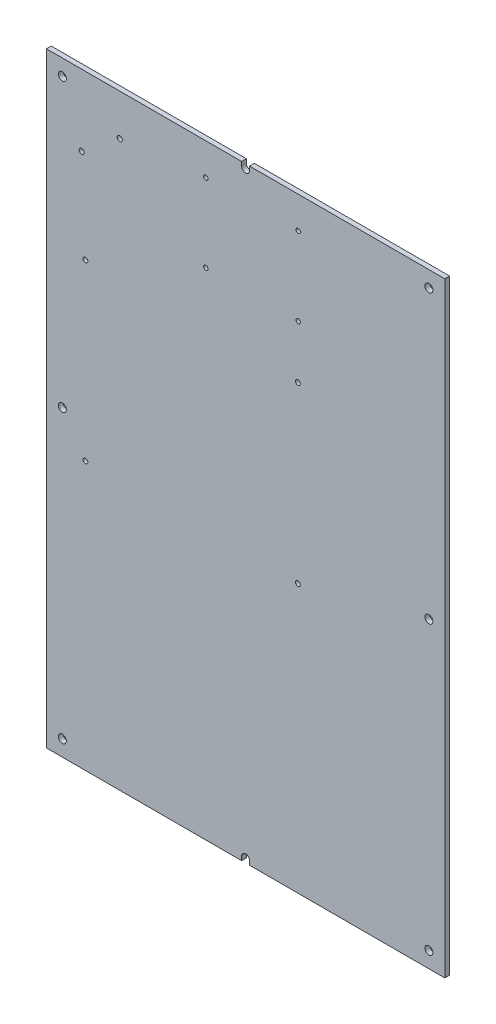
ISO-10303-21;
HEADER;
FILE_DESCRIPTION(('STEP AP214'),'2;1');
FILE_NAME('part.step','',(''),(''),'','','');
FILE_SCHEMA(('AUTOMOTIVE_DESIGN { 1 0 10303 214 1 1 1 1 }'));
ENDSEC;
DATA;
#1=APPLICATION_CONTEXT('core data for automotive mechanical design processes');
#2=APPLICATION_PROTOCOL_DEFINITION('international standard','automotive_design',2000,#1);
#3=PRODUCT_CONTEXT('',#1,'mechanical');
#4=PRODUCT('Part','Part','',(#3));
#5=PRODUCT_RELATED_PRODUCT_CATEGORY('part','',(#4));
#6=PRODUCT_DEFINITION_FORMATION('','',#4);
#7=PRODUCT_DEFINITION_CONTEXT('part definition',#1,'design');
#8=PRODUCT_DEFINITION('design','',#6,#7);
#9=PRODUCT_DEFINITION_SHAPE('','',#8);
#10=(LENGTH_UNIT() NAMED_UNIT(*) SI_UNIT(.MILLI.,.METRE.));
#11=(NAMED_UNIT(*) PLANE_ANGLE_UNIT() SI_UNIT($,.RADIAN.));
#12=(NAMED_UNIT(*) SI_UNIT($,.STERADIAN.) SOLID_ANGLE_UNIT());
#13=UNCERTAINTY_MEASURE_WITH_UNIT(LENGTH_MEASURE(1.E-05),#10,'distance_accuracy_value','');
#14=(GEOMETRIC_REPRESENTATION_CONTEXT(3) GLOBAL_UNCERTAINTY_ASSIGNED_CONTEXT((#13)) GLOBAL_UNIT_ASSIGNED_CONTEXT((#10,
#11,#12)) REPRESENTATION_CONTEXT('',''));
#15=CARTESIAN_POINT('',(0.,0.,0.));
#16=DIRECTION('',(0.,0.,1.));
#17=DIRECTION('',(1.,0.,0.));
#18=AXIS2_PLACEMENT_3D('',#15,#16,#17);
#19=CARTESIAN_POINT('',(89.8377845583719,-311.35282902829,3.));
#20=DIRECTION('',(0.,0.,-1.));
#21=DIRECTION('',(-1.,0.,0.));
#22=AXIS2_PLACEMENT_3D('',#19,#20,#21);
#23=PLANE('',#22);
#24=CARTESIAN_POINT('',(10.8490134095572,40.3288800368135,3.));
#25=DIRECTION('',(0.,0.,1.));
#26=DIRECTION('',(1.,0.,0.));
#27=AXIS2_PLACEMENT_3D('',#24,#25,#26);
#28=CIRCLE('',#27,1.6);
#29=CARTESIAN_POINT('',(12.4490134095572,40.3288800368135,3.));
#30=VERTEX_POINT('',#29);
#31=EDGE_CURVE('E338',#30,#30,#28,.T.);
#32=ORIENTED_EDGE('',*,*,#31,.F.);
#33=EDGE_LOOP('',(#32));
#34=FACE_BOUND('',#33,.T.);
#35=CARTESIAN_POINT('',(204.837784558372,-123.85282902829,3.));
#36=DIRECTION('',(0.,0.,1.));
#37=DIRECTION('',(1.,0.,0.));
#38=AXIS2_PLACEMENT_3D('',#35,#36,#37);
#39=CIRCLE('',#38,2.5);
#40=CARTESIAN_POINT('',(207.337784558372,-123.85282902829,3.));
#41=VERTEX_POINT('',#40);
#42=EDGE_CURVE('E350',#41,#41,#39,.T.);
#43=ORIENTED_EDGE('',*,*,#42,.F.);
#44=EDGE_LOOP('',(#43));
#45=FACE_BOUND('',#44,.T.);
#46=CARTESIAN_POINT('',(204.837784558372,-303.85282902829,3.));
#47=DIRECTION('',(0.,0.,1.));
#48=DIRECTION('',(1.,0.,0.));
#49=AXIS2_PLACEMENT_3D('',#46,#47,#48);
#50=CIRCLE('',#49,2.5);
#51=CARTESIAN_POINT('',(207.337784558372,-303.85282902829,3.));
#52=VERTEX_POINT('',#51);
#53=EDGE_CURVE('E362',#52,#52,#50,.T.);
#54=ORIENTED_EDGE('',*,*,#53,.F.);
#55=EDGE_LOOP('',(#54));
#56=FACE_BOUND('',#55,.T.);
#57=CARTESIAN_POINT('',(-25.1622154416282,56.14717097171,3.));
#58=DIRECTION('',(0.,0.,1.));
#59=DIRECTION('',(1.,0.,0.));
#60=AXIS2_PLACEMENT_3D('',#57,#58,#59);
#61=CIRCLE('',#60,2.5);
#62=CARTESIAN_POINT('',(-22.6622154416282,56.14717097171,3.));
#63=VERTEX_POINT('',#62);
#64=EDGE_CURVE('E374',#63,#63,#61,.T.);
#65=ORIENTED_EDGE('',*,*,#64,.F.);
#66=EDGE_LOOP('',(#65));
#67=FACE_BOUND('',#66,.T.);
#68=CARTESIAN_POINT('',(122.659013409557,-145.57282902829,3.));
#69=DIRECTION('',(0.,0.,1.));
#70=DIRECTION('',(1.,0.,0.));
#71=AXIS2_PLACEMENT_3D('',#68,#69,#70);
#72=CIRCLE('',#71,1.5);
#73=CARTESIAN_POINT('',(124.159013409557,-145.57282902829,3.));
#74=VERTEX_POINT('',#73);
#75=EDGE_CURVE('E386',#74,#74,#72,.T.);
#76=ORIENTED_EDGE('',*,*,#75,.F.);
#77=EDGE_LOOP('',(#76));
#78=FACE_BOUND('',#77,.T.);
#79=CARTESIAN_POINT('',(-10.6909865904428,-36.35282902829,3.));
#80=DIRECTION('',(0.,0.,1.));
#81=DIRECTION('',(1.,0.,0.));
#82=AXIS2_PLACEMENT_3D('',#79,#80,#81);
#83=CIRCLE('',#82,1.5);
#84=CARTESIAN_POINT('',(-9.19098659044277,-36.35282902829,3.));
#85=VERTEX_POINT('',#84);
#86=EDGE_CURVE('E398',#85,#85,#83,.T.);
#87=ORIENTED_EDGE('',*,*,#86,.F.);
#88=EDGE_LOOP('',(#87));
#89=FACE_BOUND('',#88,.T.);
#90=CARTESIAN_POINT('',(64.8377845583719,-2.85282902829004,3.));
#91=DIRECTION('',(0.,0.,1.));
#92=DIRECTION('',(1.,0.,0.));
#93=AXIS2_PLACEMENT_3D('',#90,#91,#92);
#94=CIRCLE('',#93,1.37500000000002);
#95=CARTESIAN_POINT('',(66.2127845583719,-2.85282902829004,3.));
#96=VERTEX_POINT('',#95);
#97=EDGE_CURVE('E410',#96,#96,#94,.T.);
#98=ORIENTED_EDGE('',*,*,#97,.F.);
#99=EDGE_LOOP('',(#98));
#100=FACE_BOUND('',#99,.T.);
#101=CARTESIAN_POINT('',(64.8377845583718,46.14717097171,3.));
#102=DIRECTION('',(0.,0.,1.));
#103=DIRECTION('',(1.,0.,0.));
#104=AXIS2_PLACEMENT_3D('',#101,#102,#103);
#105=CIRCLE('',#104,1.37500000000002);
#106=CARTESIAN_POINT('',(66.2127845583718,46.14717097171,3.));
#107=VERTEX_POINT('',#106);
#108=EDGE_CURVE('E156',#107,#107,#105,.T.);
#109=ORIENTED_EDGE('',*,*,#108,.F.);
#110=EDGE_LOOP('',(#109));
#111=FACE_BOUND('',#110,.T.);
#112=DIRECTION('',(-1.,0.,0.));
#113=VECTOR('',#112,1.);
#114=CARTESIAN_POINT('',(92.3377845583718,66.14717097171,3.));
#115=LINE('',#114,#113);
#116=CARTESIAN_POINT('',(214.837784558372,66.14717097171,3.));
#117=VERTEX_POINT('',#116);
#118=CARTESIAN_POINT('',(92.3377845583718,66.14717097171,3.));
#119=VERTEX_POINT('',#118);
#120=EDGE_CURVE('E175',#117,#119,#115,.T.);
#121=ORIENTED_EDGE('',*,*,#120,.T.);
#122=DIRECTION('',(0.,-1.,0.));
#123=VECTOR('',#122,1.);
#124=CARTESIAN_POINT('',(92.3377845583718,63.64717097171,3.));
#125=LINE('',#124,#123);
#126=CARTESIAN_POINT('',(92.3377845583718,63.64717097171,3.));
#127=VERTEX_POINT('',#126);
#128=EDGE_CURVE('E103',#119,#127,#125,.T.);
#129=ORIENTED_EDGE('',*,*,#128,.T.);
#130=CARTESIAN_POINT('',(89.8377845583718,63.64717097171,3.));
#131=DIRECTION('',(0.,0.,-1.));
#132=DIRECTION('',(1.,0.,0.));
#133=AXIS2_PLACEMENT_3D('',#130,#131,#132);
#134=CIRCLE('',#133,2.5);
#135=CARTESIAN_POINT('',(87.3377845583718,63.64717097171,3.));
#136=VERTEX_POINT('',#135);
#137=EDGE_CURVE('E202',#127,#136,#134,.T.);
#138=ORIENTED_EDGE('',*,*,#137,.T.);
#139=DIRECTION('',(0.,1.,0.));
#140=VECTOR('',#139,1.);
#141=CARTESIAN_POINT('',(87.3377845583718,63.64717097171,3.));
#142=LINE('',#141,#140);
#143=CARTESIAN_POINT('',(87.3377845583718,66.14717097171,3.));
#144=VERTEX_POINT('',#143);
#145=EDGE_CURVE('E221',#136,#144,#142,.T.);
#146=ORIENTED_EDGE('',*,*,#145,.T.);
#147=DIRECTION('',(-1.,0.,0.));
#148=VECTOR('',#147,1.);
#149=CARTESIAN_POINT('',(87.3377845583718,66.14717097171,3.));
#150=LINE('',#149,#148);
#151=CARTESIAN_POINT('',(-35.1622154416282,66.14717097171,3.));
#152=VERTEX_POINT('',#151);
#153=EDGE_CURVE('E218',#144,#152,#150,.T.);
#154=ORIENTED_EDGE('',*,*,#153,.T.);
#155=DIRECTION('',(0.,-1.,0.));
#156=VECTOR('',#155,1.);
#157=CARTESIAN_POINT('',(-35.1622154416282,66.14717097171,3.));
#158=LINE('',#157,#156);
#159=CARTESIAN_POINT('',(-35.1622154416282,-313.85282902829,3.));
#160=VERTEX_POINT('',#159);
#161=EDGE_CURVE('E220',#152,#160,#158,.T.);
#162=ORIENTED_EDGE('',*,*,#161,.T.);
#163=DIRECTION('',(1.,0.,0.));
#164=VECTOR('',#163,1.);
#165=CARTESIAN_POINT('',(87.3377845583719,-313.85282902829,3.));
#166=LINE('',#165,#164);
#167=CARTESIAN_POINT('',(87.3377845583719,-313.85282902829,3.));
#168=VERTEX_POINT('',#167);
#169=EDGE_CURVE('E223',#160,#168,#166,.T.);
#170=ORIENTED_EDGE('',*,*,#169,.T.);
#171=DIRECTION('',(0.,1.,0.));
#172=VECTOR('',#171,1.);
#173=CARTESIAN_POINT('',(87.3377845583719,-311.35282902829,3.));
#174=LINE('',#173,#172);
#175=CARTESIAN_POINT('',(87.3377845583719,-311.35282902829,3.));
#176=VERTEX_POINT('',#175);
#177=EDGE_CURVE('E229',#168,#176,#174,.T.);
#178=ORIENTED_EDGE('',*,*,#177,.T.);
#179=CARTESIAN_POINT('',(89.8377845583719,-311.35282902829,3.));
#180=DIRECTION('',(0.,0.,-1.));
#181=DIRECTION('',(-1.,0.,0.));
#182=AXIS2_PLACEMENT_3D('',#179,#180,#181);
#183=CIRCLE('',#182,2.50000000000002);
#184=CARTESIAN_POINT('',(92.3377845583719,-311.35282902829,3.));
#185=VERTEX_POINT('',#184);
#186=EDGE_CURVE('E134',#176,#185,#183,.T.);
#187=ORIENTED_EDGE('',*,*,#186,.T.);
#188=DIRECTION('',(0.,-1.,0.));
#189=VECTOR('',#188,1.);
#190=CARTESIAN_POINT('',(92.3377845583719,-311.35282902829,3.));
#191=LINE('',#190,#189);
#192=CARTESIAN_POINT('',(92.3377845583718,-313.85282902829,3.));
#193=VERTEX_POINT('',#192);
#194=EDGE_CURVE('E128',#185,#193,#191,.T.);
#195=ORIENTED_EDGE('',*,*,#194,.T.);
#196=DIRECTION('',(1.,0.,0.));
#197=VECTOR('',#196,1.);
#198=CARTESIAN_POINT('',(92.3377845583718,-313.85282902829,3.));
#199=LINE('',#198,#197);
#200=CARTESIAN_POINT('',(214.837784558372,-313.85282902829,3.));
#201=VERTEX_POINT('',#200);
#202=EDGE_CURVE('E132',#193,#201,#199,.T.);
#203=ORIENTED_EDGE('',*,*,#202,.T.);
#204=DIRECTION('',(0.,1.,0.));
#205=VECTOR('',#204,1.);
#206=CARTESIAN_POINT('',(214.837784558372,66.14717097171,3.));
#207=LINE('',#206,#205);
#208=EDGE_CURVE('E48',#201,#117,#207,.T.);
#209=ORIENTED_EDGE('',*,*,#208,.T.);
#210=EDGE_LOOP('',(#121,#129,#138,#146,#154,#162,#170,#178,#187,#195,#203,#209));
#211=FACE_BOUND('',#210,.T.);
#212=CARTESIAN_POINT('',(122.837784558372,46.14717097171,3.));
#213=DIRECTION('',(0.,0.,1.));
#214=DIRECTION('',(1.,0.,0.));
#215=AXIS2_PLACEMENT_3D('',#212,#213,#214);
#216=CIRCLE('',#215,1.37499999999996);
#217=CARTESIAN_POINT('',(124.212784558372,46.14717097171,3.));
#218=VERTEX_POINT('',#217);
#219=EDGE_CURVE('E416',#218,#218,#216,.T.);
#220=ORIENTED_EDGE('',*,*,#219,.F.);
#221=EDGE_LOOP('',(#220));
#222=FACE_BOUND('',#221,.T.);
#223=CARTESIAN_POINT('',(122.837784558372,-2.85282902829005,3.));
#224=DIRECTION('',(0.,0.,1.));
#225=DIRECTION('',(1.,0.,0.));
#226=AXIS2_PLACEMENT_3D('',#223,#224,#225);
#227=CIRCLE('',#226,1.37499999999999);
#228=CARTESIAN_POINT('',(124.212784558372,-2.85282902829005,3.));
#229=VERTEX_POINT('',#228);
#230=EDGE_CURVE('E404',#229,#229,#227,.T.);
#231=ORIENTED_EDGE('',*,*,#230,.F.);
#232=EDGE_LOOP('',(#231));
#233=FACE_BOUND('',#232,.T.);
#234=CARTESIAN_POINT('',(122.659013409557,-36.35282902829,3.));
#235=DIRECTION('',(0.,0.,1.));
#236=DIRECTION('',(1.,0.,0.));
#237=AXIS2_PLACEMENT_3D('',#234,#235,#236);
#238=CIRCLE('',#237,1.5);
#239=CARTESIAN_POINT('',(124.159013409557,-36.35282902829,3.));
#240=VERTEX_POINT('',#239);
#241=EDGE_CURVE('E392',#240,#240,#238,.T.);
#242=ORIENTED_EDGE('',*,*,#241,.F.);
#243=EDGE_LOOP('',(#242));
#244=FACE_BOUND('',#243,.T.);
#245=CARTESIAN_POINT('',(-10.6909865904426,-145.57282902829,3.));
#246=DIRECTION('',(0.,0.,1.));
#247=DIRECTION('',(1.,0.,0.));
#248=AXIS2_PLACEMENT_3D('',#245,#246,#247);
#249=CIRCLE('',#248,1.5);
#250=CARTESIAN_POINT('',(-9.1909865904426,-145.57282902829,3.));
#251=VERTEX_POINT('',#250);
#252=EDGE_CURVE('E380',#251,#251,#249,.T.);
#253=ORIENTED_EDGE('',*,*,#252,.F.);
#254=EDGE_LOOP('',(#253));
#255=FACE_BOUND('',#254,.T.);
#256=CARTESIAN_POINT('',(204.837784558372,56.14717097171,3.));
#257=DIRECTION('',(0.,0.,1.));
#258=DIRECTION('',(-1.,0.,0.));
#259=AXIS2_PLACEMENT_3D('',#256,#257,#258);
#260=CIRCLE('',#259,2.5);
#261=CARTESIAN_POINT('',(202.337784558372,56.14717097171,3.));
#262=VERTEX_POINT('',#261);
#263=EDGE_CURVE('E368',#262,#262,#260,.T.);
#264=ORIENTED_EDGE('',*,*,#263,.F.);
#265=EDGE_LOOP('',(#264));
#266=FACE_BOUND('',#265,.T.);
#267=CARTESIAN_POINT('',(-25.1622154416282,-303.85282902829,3.));
#268=DIRECTION('',(0.,0.,1.));
#269=DIRECTION('',(-1.,0.,0.));
#270=AXIS2_PLACEMENT_3D('',#267,#268,#269);
#271=CIRCLE('',#270,2.5);
#272=CARTESIAN_POINT('',(-27.6622154416282,-303.85282902829,3.));
#273=VERTEX_POINT('',#272);
#274=EDGE_CURVE('E356',#273,#273,#271,.T.);
#275=ORIENTED_EDGE('',*,*,#274,.F.);
#276=EDGE_LOOP('',(#275));
#277=FACE_BOUND('',#276,.T.);
#278=CARTESIAN_POINT('',(-25.1622154416281,-123.85282902829,3.));
#279=DIRECTION('',(0.,0.,1.));
#280=DIRECTION('',(-1.,0.,0.));
#281=AXIS2_PLACEMENT_3D('',#278,#279,#280);
#282=CIRCLE('',#281,2.5);
#283=CARTESIAN_POINT('',(-27.6622154416281,-123.85282902829,3.));
#284=VERTEX_POINT('',#283);
#285=EDGE_CURVE('E344',#284,#284,#282,.T.);
#286=ORIENTED_EDGE('',*,*,#285,.F.);
#287=EDGE_LOOP('',(#286));
#288=FACE_BOUND('',#287,.T.);
#289=CARTESIAN_POINT('',(-13.0209865904428,21.4888800368135,3.));
#290=DIRECTION('',(0.,0.,1.));
#291=DIRECTION('',(1.,0.,0.));
#292=AXIS2_PLACEMENT_3D('',#289,#290,#291);
#293=CIRCLE('',#292,1.6);
#294=CARTESIAN_POINT('',(-11.4209865904428,21.4888800368135,3.));
#295=VERTEX_POINT('',#294);
#296=EDGE_CURVE('E329',#295,#295,#293,.T.);
#297=ORIENTED_EDGE('',*,*,#296,.F.);
#298=EDGE_LOOP('',(#297));
#299=FACE_BOUND('',#298,.T.);
#300=ADVANCED_FACE('F31',(#34,#45,#56,#67,#78,#89,#100,#111,#211,#222,#233,#244,#255,#266,#277,
#288,#299),#23,.F.);
#301=CARTESIAN_POINT('',(89.8377845583719,-311.35282902829,0.));
#302=DIRECTION('',(0.,0.,-1.));
#303=DIRECTION('',(-1.,0.,0.));
#304=AXIS2_PLACEMENT_3D('',#301,#302,#303);
#305=PLANE('',#304);
#306=CARTESIAN_POINT('',(10.8490134095572,40.3288800368135,0.));
#307=DIRECTION('',(0.,0.,1.));
#308=DIRECTION('',(1.,0.,0.));
#309=AXIS2_PLACEMENT_3D('',#306,#307,#308);
#310=CIRCLE('',#309,1.6);
#311=CARTESIAN_POINT('',(12.4490134095572,40.3288800368135,0.));
#312=VERTEX_POINT('',#311);
#313=EDGE_CURVE('E335',#312,#312,#310,.T.);
#314=ORIENTED_EDGE('',*,*,#313,.T.);
#315=EDGE_LOOP('',(#314));
#316=FACE_BOUND('',#315,.T.);
#317=CARTESIAN_POINT('',(204.837784558372,-123.85282902829,0.));
#318=DIRECTION('',(0.,0.,1.));
#319=DIRECTION('',(1.,0.,0.));
#320=AXIS2_PLACEMENT_3D('',#317,#318,#319);
#321=CIRCLE('',#320,2.5);
#322=CARTESIAN_POINT('',(207.337784558372,-123.85282902829,0.));
#323=VERTEX_POINT('',#322);
#324=EDGE_CURVE('E347',#323,#323,#321,.T.);
#325=ORIENTED_EDGE('',*,*,#324,.T.);
#326=EDGE_LOOP('',(#325));
#327=FACE_BOUND('',#326,.T.);
#328=CARTESIAN_POINT('',(204.837784558372,-303.85282902829,0.));
#329=DIRECTION('',(0.,0.,1.));
#330=DIRECTION('',(1.,0.,0.));
#331=AXIS2_PLACEMENT_3D('',#328,#329,#330);
#332=CIRCLE('',#331,2.5);
#333=CARTESIAN_POINT('',(207.337784558372,-303.85282902829,0.));
#334=VERTEX_POINT('',#333);
#335=EDGE_CURVE('E359',#334,#334,#332,.T.);
#336=ORIENTED_EDGE('',*,*,#335,.T.);
#337=EDGE_LOOP('',(#336));
#338=FACE_BOUND('',#337,.T.);
#339=CARTESIAN_POINT('',(-25.1622154416282,56.14717097171,0.));
#340=DIRECTION('',(0.,0.,1.));
#341=DIRECTION('',(1.,0.,0.));
#342=AXIS2_PLACEMENT_3D('',#339,#340,#341);
#343=CIRCLE('',#342,2.5);
#344=CARTESIAN_POINT('',(-22.6622154416282,56.14717097171,0.));
#345=VERTEX_POINT('',#344);
#346=EDGE_CURVE('E371',#345,#345,#343,.T.);
#347=ORIENTED_EDGE('',*,*,#346,.T.);
#348=EDGE_LOOP('',(#347));
#349=FACE_BOUND('',#348,.T.);
#350=CARTESIAN_POINT('',(122.659013409557,-145.57282902829,0.));
#351=DIRECTION('',(0.,0.,1.));
#352=DIRECTION('',(1.,0.,0.));
#353=AXIS2_PLACEMENT_3D('',#350,#351,#352);
#354=CIRCLE('',#353,1.5);
#355=CARTESIAN_POINT('',(124.159013409557,-145.57282902829,0.));
#356=VERTEX_POINT('',#355);
#357=EDGE_CURVE('E383',#356,#356,#354,.T.);
#358=ORIENTED_EDGE('',*,*,#357,.T.);
#359=EDGE_LOOP('',(#358));
#360=FACE_BOUND('',#359,.T.);
#361=CARTESIAN_POINT('',(-10.6909865904428,-36.35282902829,0.));
#362=DIRECTION('',(0.,0.,1.));
#363=DIRECTION('',(1.,0.,0.));
#364=AXIS2_PLACEMENT_3D('',#361,#362,#363);
#365=CIRCLE('',#364,1.5);
#366=CARTESIAN_POINT('',(-9.19098659044277,-36.35282902829,0.));
#367=VERTEX_POINT('',#366);
#368=EDGE_CURVE('E395',#367,#367,#365,.T.);
#369=ORIENTED_EDGE('',*,*,#368,.T.);
#370=EDGE_LOOP('',(#369));
#371=FACE_BOUND('',#370,.T.);
#372=CARTESIAN_POINT('',(64.8377845583719,-2.85282902829004,0.));
#373=DIRECTION('',(0.,0.,1.));
#374=DIRECTION('',(1.,0.,0.));
#375=AXIS2_PLACEMENT_3D('',#372,#373,#374);
#376=CIRCLE('',#375,1.37500000000002);
#377=CARTESIAN_POINT('',(66.2127845583719,-2.85282902829004,0.));
#378=VERTEX_POINT('',#377);
#379=EDGE_CURVE('E407',#378,#378,#376,.T.);
#380=ORIENTED_EDGE('',*,*,#379,.T.);
#381=EDGE_LOOP('',(#380));
#382=FACE_BOUND('',#381,.T.);
#383=CARTESIAN_POINT('',(64.8377845583718,46.14717097171,0.));
#384=DIRECTION('',(0.,0.,1.));
#385=DIRECTION('',(1.,0.,0.));
#386=AXIS2_PLACEMENT_3D('',#383,#384,#385);
#387=CIRCLE('',#386,1.37500000000002);
#388=CARTESIAN_POINT('',(66.2127845583718,46.14717097171,0.));
#389=VERTEX_POINT('',#388);
#390=EDGE_CURVE('E419',#389,#389,#387,.T.);
#391=ORIENTED_EDGE('',*,*,#390,.T.);
#392=EDGE_LOOP('',(#391));
#393=FACE_BOUND('',#392,.T.);
#394=DIRECTION('',(-1.,0.,0.));
#395=VECTOR('',#394,1.);
#396=CARTESIAN_POINT('',(92.3377845583718,66.14717097171,0.));
#397=LINE('',#396,#395);
#398=CARTESIAN_POINT('',(214.837784558372,66.14717097171,0.));
#399=VERTEX_POINT('',#398);
#400=CARTESIAN_POINT('',(92.3377845583718,66.14717097171,0.));
#401=VERTEX_POINT('',#400);
#402=EDGE_CURVE('E152',#399,#401,#397,.T.);
#403=ORIENTED_EDGE('',*,*,#402,.F.);
#404=DIRECTION('',(0.,1.,0.));
#405=VECTOR('',#404,1.);
#406=CARTESIAN_POINT('',(214.837784558372,66.14717097171,0.));
#407=LINE('',#406,#405);
#408=CARTESIAN_POINT('',(214.837784558372,-313.85282902829,0.));
#409=VERTEX_POINT('',#408);
#410=EDGE_CURVE('E95',#409,#399,#407,.T.);
#411=ORIENTED_EDGE('',*,*,#410,.F.);
#412=DIRECTION('',(1.,0.,0.));
#413=VECTOR('',#412,1.);
#414=CARTESIAN_POINT('',(92.3377845583718,-313.85282902829,0.));
#415=LINE('',#414,#413);
#416=CARTESIAN_POINT('',(92.3377845583718,-313.85282902829,0.));
#417=VERTEX_POINT('',#416);
#418=EDGE_CURVE('E89',#417,#409,#415,.T.);
#419=ORIENTED_EDGE('',*,*,#418,.F.);
#420=DIRECTION('',(0.,-1.,0.));
#421=VECTOR('',#420,1.);
#422=CARTESIAN_POINT('',(92.3377845583719,-311.35282902829,0.));
#423=LINE('',#422,#421);
#424=CARTESIAN_POINT('',(92.3377845583719,-311.35282902829,0.));
#425=VERTEX_POINT('',#424);
#426=EDGE_CURVE('E142',#425,#417,#423,.T.);
#427=ORIENTED_EDGE('',*,*,#426,.F.);
#428=CARTESIAN_POINT('',(89.8377845583719,-311.35282902829,0.));
#429=DIRECTION('',(0.,0.,-1.));
#430=DIRECTION('',(-1.,0.,0.));
#431=AXIS2_PLACEMENT_3D('',#428,#429,#430);
#432=CIRCLE('',#431,2.50000000000002);
#433=CARTESIAN_POINT('',(87.3377845583719,-311.35282902829,0.));
#434=VERTEX_POINT('',#433);
#435=EDGE_CURVE('E170',#434,#425,#432,.T.);
#436=ORIENTED_EDGE('',*,*,#435,.F.);
#437=DIRECTION('',(0.,1.,0.));
#438=VECTOR('',#437,1.);
#439=CARTESIAN_POINT('',(87.3377845583719,-311.35282902829,0.));
#440=LINE('',#439,#438);
#441=CARTESIAN_POINT('',(87.3377845583719,-313.85282902829,0.));
#442=VERTEX_POINT('',#441);
#443=EDGE_CURVE('E168',#442,#434,#440,.T.);
#444=ORIENTED_EDGE('',*,*,#443,.F.);
#445=DIRECTION('',(1.,0.,0.));
#446=VECTOR('',#445,1.);
#447=CARTESIAN_POINT('',(87.3377845583719,-313.85282902829,0.));
#448=LINE('',#447,#446);
#449=CARTESIAN_POINT('',(-35.1622154416282,-313.85282902829,0.));
#450=VERTEX_POINT('',#449);
#451=EDGE_CURVE('E166',#450,#442,#448,.T.);
#452=ORIENTED_EDGE('',*,*,#451,.F.);
#453=DIRECTION('',(0.,-1.,0.));
#454=VECTOR('',#453,1.);
#455=CARTESIAN_POINT('',(-35.1622154416282,66.14717097171,0.));
#456=LINE('',#455,#454);
#457=CARTESIAN_POINT('',(-35.1622154416282,66.14717097171,0.));
#458=VERTEX_POINT('',#457);
#459=EDGE_CURVE('E164',#458,#450,#456,.T.);
#460=ORIENTED_EDGE('',*,*,#459,.F.);
#461=DIRECTION('',(-1.,0.,0.));
#462=VECTOR('',#461,1.);
#463=CARTESIAN_POINT('',(87.3377845583718,66.14717097171,0.));
#464=LINE('',#463,#462);
#465=CARTESIAN_POINT('',(87.3377845583718,66.14717097171,0.));
#466=VERTEX_POINT('',#465);
#467=EDGE_CURVE('E162',#466,#458,#464,.T.);
#468=ORIENTED_EDGE('',*,*,#467,.F.);
#469=DIRECTION('',(0.,1.,0.));
#470=VECTOR('',#469,1.);
#471=CARTESIAN_POINT('',(87.3377845583718,63.64717097171,0.));
#472=LINE('',#471,#470);
#473=CARTESIAN_POINT('',(87.3377845583718,63.64717097171,0.));
#474=VERTEX_POINT('',#473);
#475=EDGE_CURVE('E160',#474,#466,#472,.T.);
#476=ORIENTED_EDGE('',*,*,#475,.F.);
#477=CARTESIAN_POINT('',(89.8377845583718,63.64717097171,0.));
#478=DIRECTION('',(0.,0.,-1.));
#479=DIRECTION('',(1.,0.,0.));
#480=AXIS2_PLACEMENT_3D('',#477,#478,#479);
#481=CIRCLE('',#480,2.5);
#482=CARTESIAN_POINT('',(92.3377845583718,63.64717097171,0.));
#483=VERTEX_POINT('',#482);
#484=EDGE_CURVE('E158',#483,#474,#481,.T.);
#485=ORIENTED_EDGE('',*,*,#484,.F.);
#486=DIRECTION('',(0.,-1.,0.));
#487=VECTOR('',#486,1.);
#488=CARTESIAN_POINT('',(92.3377845583718,63.64717097171,0.));
#489=LINE('',#488,#487);
#490=EDGE_CURVE('E155',#401,#483,#489,.T.);
#491=ORIENTED_EDGE('',*,*,#490,.F.);
#492=EDGE_LOOP('',(#403,#411,#419,#427,#436,#444,#452,#460,#468,#476,#485,#491));
#493=FACE_BOUND('',#492,.T.);
#494=CARTESIAN_POINT('',(122.837784558372,46.14717097171,0.));
#495=DIRECTION('',(0.,0.,1.));
#496=DIRECTION('',(1.,0.,0.));
#497=AXIS2_PLACEMENT_3D('',#494,#495,#496);
#498=CIRCLE('',#497,1.37499999999996);
#499=CARTESIAN_POINT('',(124.212784558372,46.14717097171,0.));
#500=VERTEX_POINT('',#499);
#501=EDGE_CURVE('E413',#500,#500,#498,.T.);
#502=ORIENTED_EDGE('',*,*,#501,.T.);
#503=EDGE_LOOP('',(#502));
#504=FACE_BOUND('',#503,.T.);
#505=CARTESIAN_POINT('',(122.837784558372,-2.85282902829005,0.));
#506=DIRECTION('',(0.,0.,1.));
#507=DIRECTION('',(1.,0.,0.));
#508=AXIS2_PLACEMENT_3D('',#505,#506,#507);
#509=CIRCLE('',#508,1.37499999999999);
#510=CARTESIAN_POINT('',(124.212784558372,-2.85282902829005,0.));
#511=VERTEX_POINT('',#510);
#512=EDGE_CURVE('E401',#511,#511,#509,.T.);
#513=ORIENTED_EDGE('',*,*,#512,.T.);
#514=EDGE_LOOP('',(#513));
#515=FACE_BOUND('',#514,.T.);
#516=CARTESIAN_POINT('',(122.659013409557,-36.35282902829,0.));
#517=DIRECTION('',(0.,0.,1.));
#518=DIRECTION('',(1.,0.,0.));
#519=AXIS2_PLACEMENT_3D('',#516,#517,#518);
#520=CIRCLE('',#519,1.5);
#521=CARTESIAN_POINT('',(124.159013409557,-36.35282902829,0.));
#522=VERTEX_POINT('',#521);
#523=EDGE_CURVE('E389',#522,#522,#520,.T.);
#524=ORIENTED_EDGE('',*,*,#523,.T.);
#525=EDGE_LOOP('',(#524));
#526=FACE_BOUND('',#525,.T.);
#527=CARTESIAN_POINT('',(-10.6909865904426,-145.57282902829,0.));
#528=DIRECTION('',(0.,0.,1.));
#529=DIRECTION('',(1.,0.,0.));
#530=AXIS2_PLACEMENT_3D('',#527,#528,#529);
#531=CIRCLE('',#530,1.5);
#532=CARTESIAN_POINT('',(-9.1909865904426,-145.57282902829,0.));
#533=VERTEX_POINT('',#532);
#534=EDGE_CURVE('E377',#533,#533,#531,.T.);
#535=ORIENTED_EDGE('',*,*,#534,.T.);
#536=EDGE_LOOP('',(#535));
#537=FACE_BOUND('',#536,.T.);
#538=CARTESIAN_POINT('',(204.837784558372,56.14717097171,0.));
#539=DIRECTION('',(0.,0.,1.));
#540=DIRECTION('',(-1.,0.,0.));
#541=AXIS2_PLACEMENT_3D('',#538,#539,#540);
#542=CIRCLE('',#541,2.5);
#543=CARTESIAN_POINT('',(202.337784558372,56.14717097171,0.));
#544=VERTEX_POINT('',#543);
#545=EDGE_CURVE('E365',#544,#544,#542,.T.);
#546=ORIENTED_EDGE('',*,*,#545,.T.);
#547=EDGE_LOOP('',(#546));
#548=FACE_BOUND('',#547,.T.);
#549=CARTESIAN_POINT('',(-25.1622154416282,-303.85282902829,0.));
#550=DIRECTION('',(0.,0.,1.));
#551=DIRECTION('',(-1.,0.,0.));
#552=AXIS2_PLACEMENT_3D('',#549,#550,#551);
#553=CIRCLE('',#552,2.5);
#554=CARTESIAN_POINT('',(-27.6622154416282,-303.85282902829,0.));
#555=VERTEX_POINT('',#554);
#556=EDGE_CURVE('E353',#555,#555,#553,.T.);
#557=ORIENTED_EDGE('',*,*,#556,.T.);
#558=EDGE_LOOP('',(#557));
#559=FACE_BOUND('',#558,.T.);
#560=CARTESIAN_POINT('',(-25.1622154416281,-123.85282902829,0.));
#561=DIRECTION('',(0.,0.,1.));
#562=DIRECTION('',(-1.,0.,0.));
#563=AXIS2_PLACEMENT_3D('',#560,#561,#562);
#564=CIRCLE('',#563,2.5);
#565=CARTESIAN_POINT('',(-27.6622154416281,-123.85282902829,0.));
#566=VERTEX_POINT('',#565);
#567=EDGE_CURVE('E341',#566,#566,#564,.T.);
#568=ORIENTED_EDGE('',*,*,#567,.T.);
#569=EDGE_LOOP('',(#568));
#570=FACE_BOUND('',#569,.T.);
#571=CARTESIAN_POINT('',(-13.0209865904428,21.4888800368135,0.));
#572=DIRECTION('',(0.,0.,1.));
#573=DIRECTION('',(1.,0.,0.));
#574=AXIS2_PLACEMENT_3D('',#571,#572,#573);
#575=CIRCLE('',#574,1.6);
#576=CARTESIAN_POINT('',(-11.4209865904428,21.4888800368135,0.));
#577=VERTEX_POINT('',#576);
#578=EDGE_CURVE('E332',#577,#577,#575,.T.);
#579=ORIENTED_EDGE('',*,*,#578,.T.);
#580=EDGE_LOOP('',(#579));
#581=FACE_BOUND('',#580,.T.);
#582=ADVANCED_FACE('F206',(#316,#327,#338,#349,#360,#371,#382,#393,#493,#504,#515,#526,#537,
#548,#559,#570,#581),#305,.T.);
#583=CARTESIAN_POINT('',(92.3377845583718,66.14717097171,3.));
#584=DIRECTION('',(0.,-1.,0.));
#585=DIRECTION('',(1.,0.,0.));
#586=AXIS2_PLACEMENT_3D('',#583,#584,#585);
#587=PLANE('',#586);
#588=ORIENTED_EDGE('',*,*,#402,.T.);
#589=DIRECTION('',(0.,0.,-1.));
#590=VECTOR('',#589,1.);
#591=CARTESIAN_POINT('',(92.3377845583718,66.14717097171,3.));
#592=LINE('',#591,#590);
#593=EDGE_CURVE('E11',#119,#401,#592,.T.);
#594=ORIENTED_EDGE('',*,*,#593,.F.);
#595=ORIENTED_EDGE('',*,*,#120,.F.);
#596=DIRECTION('',(0.,0.,-1.));
#597=VECTOR('',#596,1.);
#598=CARTESIAN_POINT('',(214.837784558372,66.14717097171,3.));
#599=LINE('',#598,#597);
#600=EDGE_CURVE('E148',#117,#399,#599,.T.);
#601=ORIENTED_EDGE('',*,*,#600,.T.);
#602=EDGE_LOOP('',(#588,#594,#595,#601));
#603=FACE_BOUND('',#602,.T.);
#604=ADVANCED_FACE('F33',(#603),#587,.F.);
#605=CARTESIAN_POINT('',(92.3377845583718,63.64717097171,3.));
#606=DIRECTION('',(1.,0.,0.));
#607=DIRECTION('',(0.,1.,0.));
#608=AXIS2_PLACEMENT_3D('',#605,#606,#607);
#609=PLANE('',#608);
#610=ORIENTED_EDGE('',*,*,#490,.T.);
#611=DIRECTION('',(0.,0.,-1.));
#612=VECTOR('',#611,1.);
#613=CARTESIAN_POINT('',(92.3377845583718,63.64717097171,3.));
#614=LINE('',#613,#612);
#615=EDGE_CURVE('E40',#127,#483,#614,.T.);
#616=ORIENTED_EDGE('',*,*,#615,.F.);
#617=ORIENTED_EDGE('',*,*,#128,.F.);
#618=ORIENTED_EDGE('',*,*,#593,.T.);
#619=EDGE_LOOP('',(#610,#616,#617,#618));
#620=FACE_BOUND('',#619,.T.);
#621=ADVANCED_FACE('F636',(#620),#609,.F.);
#622=CARTESIAN_POINT('',(89.8377845583718,63.64717097171,3.));
#623=DIRECTION('',(0.,0.,-1.));
#624=DIRECTION('',(-1.,0.,0.));
#625=AXIS2_PLACEMENT_3D('',#622,#623,#624);
#626=CYLINDRICAL_SURFACE('',#625,2.5);
#627=ORIENTED_EDGE('',*,*,#484,.T.);
#628=DIRECTION('',(0.,0.,-1.));
#629=VECTOR('',#628,1.);
#630=CARTESIAN_POINT('',(87.3377845583718,63.64717097171,3.));
#631=LINE('',#630,#629);
#632=EDGE_CURVE('E194',#136,#474,#631,.T.);
#633=ORIENTED_EDGE('',*,*,#632,.F.);
#634=ORIENTED_EDGE('',*,*,#137,.F.);
#635=ORIENTED_EDGE('',*,*,#615,.T.);
#636=EDGE_LOOP('',(#627,#633,#634,#635));
#637=FACE_BOUND('',#636,.T.);
#638=ADVANCED_FACE('F200',(#637),#626,.F.);
#639=CARTESIAN_POINT('',(87.3377845583718,63.64717097171,3.));
#640=DIRECTION('',(-1.,0.,0.));
#641=DIRECTION('',(0.,-1.,0.));
#642=AXIS2_PLACEMENT_3D('',#639,#640,#641);
#643=PLANE('',#642);
#644=ORIENTED_EDGE('',*,*,#475,.T.);
#645=DIRECTION('',(0.,0.,-1.));
#646=VECTOR('',#645,1.);
#647=CARTESIAN_POINT('',(87.3377845583718,66.14717097171,3.));
#648=LINE('',#647,#646);
#649=EDGE_CURVE('E191',#144,#466,#648,.T.);
#650=ORIENTED_EDGE('',*,*,#649,.F.);
#651=ORIENTED_EDGE('',*,*,#145,.F.);
#652=ORIENTED_EDGE('',*,*,#632,.T.);
#653=EDGE_LOOP('',(#644,#650,#651,#652));
#654=FACE_BOUND('',#653,.T.);
#655=ADVANCED_FACE('F212',(#654),#643,.F.);
#656=CARTESIAN_POINT('',(87.3377845583718,66.14717097171,3.));
#657=DIRECTION('',(0.,-1.,0.));
#658=DIRECTION('',(0.,0.,-1.));
#659=AXIS2_PLACEMENT_3D('',#656,#657,#658);
#660=PLANE('',#659);
#661=ORIENTED_EDGE('',*,*,#467,.T.);
#662=DIRECTION('',(0.,0.,-1.));
#663=VECTOR('',#662,1.);
#664=CARTESIAN_POINT('',(-35.1622154416282,66.14717097171,3.));
#665=LINE('',#664,#663);
#666=EDGE_CURVE('E188',#152,#458,#665,.T.);
#667=ORIENTED_EDGE('',*,*,#666,.F.);
#668=ORIENTED_EDGE('',*,*,#153,.F.);
#669=ORIENTED_EDGE('',*,*,#649,.T.);
#670=EDGE_LOOP('',(#661,#667,#668,#669));
#671=FACE_BOUND('',#670,.T.);
#672=ADVANCED_FACE('F216',(#671),#660,.F.);
#673=CARTESIAN_POINT('',(-35.1622154416282,66.14717097171,3.));
#674=DIRECTION('',(1.,0.,0.));
#675=DIRECTION('',(0.,0.,-1.));
#676=AXIS2_PLACEMENT_3D('',#673,#674,#675);
#677=PLANE('',#676);
#678=ORIENTED_EDGE('',*,*,#459,.T.);
#679=DIRECTION('',(0.,0.,-1.));
#680=VECTOR('',#679,1.);
#681=CARTESIAN_POINT('',(-35.1622154416282,-313.85282902829,3.));
#682=LINE('',#681,#680);
#683=EDGE_CURVE('E185',#160,#450,#682,.T.);
#684=ORIENTED_EDGE('',*,*,#683,.F.);
#685=ORIENTED_EDGE('',*,*,#161,.F.);
#686=ORIENTED_EDGE('',*,*,#666,.T.);
#687=EDGE_LOOP('',(#678,#684,#685,#686));
#688=FACE_BOUND('',#687,.T.);
#689=ADVANCED_FACE('F601',(#688),#677,.F.);
#690=CARTESIAN_POINT('',(87.3377845583719,-313.85282902829,3.));
#691=DIRECTION('',(0.,1.,0.));
#692=DIRECTION('',(0.,0.,1.));
#693=AXIS2_PLACEMENT_3D('',#690,#691,#692);
#694=PLANE('',#693);
#695=ORIENTED_EDGE('',*,*,#451,.T.);
#696=DIRECTION('',(0.,0.,-1.));
#697=VECTOR('',#696,1.);
#698=CARTESIAN_POINT('',(87.3377845583719,-313.85282902829,3.));
#699=LINE('',#698,#697);
#700=EDGE_CURVE('E182',#168,#442,#699,.T.);
#701=ORIENTED_EDGE('',*,*,#700,.F.);
#702=ORIENTED_EDGE('',*,*,#169,.F.);
#703=ORIENTED_EDGE('',*,*,#683,.T.);
#704=EDGE_LOOP('',(#695,#701,#702,#703));
#705=FACE_BOUND('',#704,.T.);
#706=ADVANCED_FACE('F592',(#705),#694,.F.);
#707=CARTESIAN_POINT('',(87.3377845583719,-311.35282902829,3.));
#708=DIRECTION('',(-1.,0.,0.));
#709=DIRECTION('',(0.,0.,1.));
#710=AXIS2_PLACEMENT_3D('',#707,#708,#709);
#711=PLANE('',#710);
#712=ORIENTED_EDGE('',*,*,#443,.T.);
#713=DIRECTION('',(0.,0.,-1.));
#714=VECTOR('',#713,1.);
#715=CARTESIAN_POINT('',(87.3377845583719,-311.35282902829,3.));
#716=LINE('',#715,#714);
#717=EDGE_CURVE('E179',#176,#434,#716,.T.);
#718=ORIENTED_EDGE('',*,*,#717,.F.);
#719=ORIENTED_EDGE('',*,*,#177,.F.);
#720=ORIENTED_EDGE('',*,*,#700,.T.);
#721=EDGE_LOOP('',(#712,#718,#719,#720));
#722=FACE_BOUND('',#721,.T.);
#723=ADVANCED_FACE('F235',(#722),#711,.F.);
#724=CARTESIAN_POINT('',(89.8377845583719,-311.35282902829,3.));
#725=DIRECTION('',(0.,0.,-1.));
#726=DIRECTION('',(-1.,0.,0.));
#727=AXIS2_PLACEMENT_3D('',#724,#725,#726);
#728=CYLINDRICAL_SURFACE('',#727,2.50000000000002);
#729=ORIENTED_EDGE('',*,*,#435,.T.);
#730=DIRECTION('',(0.,0.,-1.));
#731=VECTOR('',#730,1.);
#732=CARTESIAN_POINT('',(92.3377845583719,-311.35282902829,3.));
#733=LINE('',#732,#731);
#734=EDGE_CURVE('E143',#185,#425,#733,.T.);
#735=ORIENTED_EDGE('',*,*,#734,.F.);
#736=ORIENTED_EDGE('',*,*,#186,.F.);
#737=ORIENTED_EDGE('',*,*,#717,.T.);
#738=EDGE_LOOP('',(#729,#735,#736,#737));
#739=FACE_BOUND('',#738,.T.);
#740=ADVANCED_FACE('F239',(#739),#728,.F.);
#741=CARTESIAN_POINT('',(92.3377845583719,-311.35282902829,3.));
#742=DIRECTION('',(1.,0.,0.));
#743=DIRECTION('',(0.,1.,0.));
#744=AXIS2_PLACEMENT_3D('',#741,#742,#743);
#745=PLANE('',#744);
#746=ORIENTED_EDGE('',*,*,#426,.T.);
#747=DIRECTION('',(0.,0.,-1.));
#748=VECTOR('',#747,1.);
#749=CARTESIAN_POINT('',(92.3377845583718,-313.85282902829,3.));
#750=LINE('',#749,#748);
#751=EDGE_CURVE('E139',#193,#417,#750,.T.);
#752=ORIENTED_EDGE('',*,*,#751,.F.);
#753=ORIENTED_EDGE('',*,*,#194,.F.);
#754=ORIENTED_EDGE('',*,*,#734,.T.);
#755=EDGE_LOOP('',(#746,#752,#753,#754));
#756=FACE_BOUND('',#755,.T.);
#757=ADVANCED_FACE('F140',(#756),#745,.F.);
#758=CARTESIAN_POINT('',(92.3377845583718,-313.85282902829,3.));
#759=DIRECTION('',(0.,1.,0.));
#760=DIRECTION('',(0.,0.,1.));
#761=AXIS2_PLACEMENT_3D('',#758,#759,#760);
#762=PLANE('',#761);
#763=ORIENTED_EDGE('',*,*,#418,.T.);
#764=DIRECTION('',(0.,0.,-1.));
#765=VECTOR('',#764,1.);
#766=CARTESIAN_POINT('',(214.837784558372,-313.85282902829,3.));
#767=LINE('',#766,#765);
#768=EDGE_CURVE('E144',#201,#409,#767,.T.);
#769=ORIENTED_EDGE('',*,*,#768,.F.);
#770=ORIENTED_EDGE('',*,*,#202,.F.);
#771=ORIENTED_EDGE('',*,*,#751,.T.);
#772=EDGE_LOOP('',(#763,#769,#770,#771));
#773=FACE_BOUND('',#772,.T.);
#774=ADVANCED_FACE('F146',(#773),#762,.F.);
#775=CARTESIAN_POINT('',(214.837784558372,66.14717097171,3.));
#776=DIRECTION('',(-1.,0.,0.));
#777=DIRECTION('',(0.,0.,1.));
#778=AXIS2_PLACEMENT_3D('',#775,#776,#777);
#779=PLANE('',#778);
#780=ORIENTED_EDGE('',*,*,#410,.T.);
#781=ORIENTED_EDGE('',*,*,#600,.F.);
#782=ORIENTED_EDGE('',*,*,#208,.F.);
#783=ORIENTED_EDGE('',*,*,#768,.T.);
#784=EDGE_LOOP('',(#780,#781,#782,#783));
#785=FACE_BOUND('',#784,.T.);
#786=ADVANCED_FACE('F243',(#785),#779,.F.);
#787=CARTESIAN_POINT('',(64.8377845583718,46.14717097171,3.));
#788=DIRECTION('',(0.,0.,-1.));
#789=DIRECTION('',(-1.,0.,0.));
#790=AXIS2_PLACEMENT_3D('',#787,#788,#789);
#791=CYLINDRICAL_SURFACE('',#790,1.37500000000002);
#792=ORIENTED_EDGE('',*,*,#108,.T.);
#793=EDGE_LOOP('',(#792));
#794=FACE_BOUND('',#793,.T.);
#795=ORIENTED_EDGE('',*,*,#390,.F.);
#796=EDGE_LOOP('',(#795));
#797=FACE_BOUND('',#796,.T.);
#798=ADVANCED_FACE('F245',(#794,#797),#791,.F.);
#799=CARTESIAN_POINT('',(122.837784558372,46.14717097171,3.));
#800=DIRECTION('',(0.,0.,-1.));
#801=DIRECTION('',(-1.,0.,0.));
#802=AXIS2_PLACEMENT_3D('',#799,#800,#801);
#803=CYLINDRICAL_SURFACE('',#802,1.37499999999996);
#804=ORIENTED_EDGE('',*,*,#219,.T.);
#805=EDGE_LOOP('',(#804));
#806=FACE_BOUND('',#805,.T.);
#807=ORIENTED_EDGE('',*,*,#501,.F.);
#808=EDGE_LOOP('',(#807));
#809=FACE_BOUND('',#808,.T.);
#810=ADVANCED_FACE('F251',(#806,#809),#803,.F.);
#811=CARTESIAN_POINT('',(64.8377845583719,-2.85282902829004,3.));
#812=DIRECTION('',(0.,0.,-1.));
#813=DIRECTION('',(-1.,0.,0.));
#814=AXIS2_PLACEMENT_3D('',#811,#812,#813);
#815=CYLINDRICAL_SURFACE('',#814,1.37500000000002);
#816=ORIENTED_EDGE('',*,*,#97,.T.);
#817=EDGE_LOOP('',(#816));
#818=FACE_BOUND('',#817,.T.);
#819=ORIENTED_EDGE('',*,*,#379,.F.);
#820=EDGE_LOOP('',(#819));
#821=FACE_BOUND('',#820,.T.);
#822=ADVANCED_FACE('F268',(#818,#821),#815,.F.);
#823=CARTESIAN_POINT('',(122.837784558372,-2.85282902829005,3.));
#824=DIRECTION('',(0.,0.,-1.));
#825=DIRECTION('',(-1.,0.,0.));
#826=AXIS2_PLACEMENT_3D('',#823,#824,#825);
#827=CYLINDRICAL_SURFACE('',#826,1.37499999999999);
#828=ORIENTED_EDGE('',*,*,#230,.T.);
#829=EDGE_LOOP('',(#828));
#830=FACE_BOUND('',#829,.T.);
#831=ORIENTED_EDGE('',*,*,#512,.F.);
#832=EDGE_LOOP('',(#831));
#833=FACE_BOUND('',#832,.T.);
#834=ADVANCED_FACE('F272',(#830,#833),#827,.F.);
#835=CARTESIAN_POINT('',(-10.6909865904428,-36.35282902829,3.));
#836=DIRECTION('',(0.,0.,-1.));
#837=DIRECTION('',(-1.,0.,0.));
#838=AXIS2_PLACEMENT_3D('',#835,#836,#837);
#839=CYLINDRICAL_SURFACE('',#838,1.5);
#840=ORIENTED_EDGE('',*,*,#86,.T.);
#841=EDGE_LOOP('',(#840));
#842=FACE_BOUND('',#841,.T.);
#843=ORIENTED_EDGE('',*,*,#368,.F.);
#844=EDGE_LOOP('',(#843));
#845=FACE_BOUND('',#844,.T.);
#846=ADVANCED_FACE('F276',(#842,#845),#839,.F.);
#847=CARTESIAN_POINT('',(122.659013409557,-36.35282902829,3.));
#848=DIRECTION('',(0.,0.,-1.));
#849=DIRECTION('',(-1.,0.,0.));
#850=AXIS2_PLACEMENT_3D('',#847,#848,#849);
#851=CYLINDRICAL_SURFACE('',#850,1.5);
#852=ORIENTED_EDGE('',*,*,#241,.T.);
#853=EDGE_LOOP('',(#852));
#854=FACE_BOUND('',#853,.T.);
#855=ORIENTED_EDGE('',*,*,#523,.F.);
#856=EDGE_LOOP('',(#855));
#857=FACE_BOUND('',#856,.T.);
#858=ADVANCED_FACE('F280',(#854,#857),#851,.F.);
#859=CARTESIAN_POINT('',(122.659013409557,-145.57282902829,3.));
#860=DIRECTION('',(0.,0.,-1.));
#861=DIRECTION('',(-1.,0.,0.));
#862=AXIS2_PLACEMENT_3D('',#859,#860,#861);
#863=CYLINDRICAL_SURFACE('',#862,1.5);
#864=ORIENTED_EDGE('',*,*,#75,.T.);
#865=EDGE_LOOP('',(#864));
#866=FACE_BOUND('',#865,.T.);
#867=ORIENTED_EDGE('',*,*,#357,.F.);
#868=EDGE_LOOP('',(#867));
#869=FACE_BOUND('',#868,.T.);
#870=ADVANCED_FACE('F284',(#866,#869),#863,.F.);
#871=CARTESIAN_POINT('',(-10.6909865904426,-145.57282902829,3.));
#872=DIRECTION('',(0.,0.,-1.));
#873=DIRECTION('',(-1.,0.,0.));
#874=AXIS2_PLACEMENT_3D('',#871,#872,#873);
#875=CYLINDRICAL_SURFACE('',#874,1.5);
#876=ORIENTED_EDGE('',*,*,#252,.T.);
#877=EDGE_LOOP('',(#876));
#878=FACE_BOUND('',#877,.T.);
#879=ORIENTED_EDGE('',*,*,#534,.F.);
#880=EDGE_LOOP('',(#879));
#881=FACE_BOUND('',#880,.T.);
#882=ADVANCED_FACE('F288',(#878,#881),#875,.F.);
#883=CARTESIAN_POINT('',(-25.1622154416282,56.14717097171,3.));
#884=DIRECTION('',(0.,0.,-1.));
#885=DIRECTION('',(-1.,0.,0.));
#886=AXIS2_PLACEMENT_3D('',#883,#884,#885);
#887=CYLINDRICAL_SURFACE('',#886,2.5);
#888=ORIENTED_EDGE('',*,*,#64,.T.);
#889=EDGE_LOOP('',(#888));
#890=FACE_BOUND('',#889,.T.);
#891=ORIENTED_EDGE('',*,*,#346,.F.);
#892=EDGE_LOOP('',(#891));
#893=FACE_BOUND('',#892,.T.);
#894=ADVANCED_FACE('F292',(#890,#893),#887,.F.);
#895=CARTESIAN_POINT('',(204.837784558372,56.14717097171,3.));
#896=DIRECTION('',(0.,0.,-1.));
#897=DIRECTION('',(-1.,0.,0.));
#898=AXIS2_PLACEMENT_3D('',#895,#896,#897);
#899=CYLINDRICAL_SURFACE('',#898,2.5);
#900=ORIENTED_EDGE('',*,*,#263,.T.);
#901=EDGE_LOOP('',(#900));
#902=FACE_BOUND('',#901,.T.);
#903=ORIENTED_EDGE('',*,*,#545,.F.);
#904=EDGE_LOOP('',(#903));
#905=FACE_BOUND('',#904,.T.);
#906=ADVANCED_FACE('F296',(#902,#905),#899,.F.);
#907=CARTESIAN_POINT('',(204.837784558372,-303.85282902829,3.));
#908=DIRECTION('',(0.,0.,-1.));
#909=DIRECTION('',(-1.,0.,0.));
#910=AXIS2_PLACEMENT_3D('',#907,#908,#909);
#911=CYLINDRICAL_SURFACE('',#910,2.5);
#912=ORIENTED_EDGE('',*,*,#53,.T.);
#913=EDGE_LOOP('',(#912));
#914=FACE_BOUND('',#913,.T.);
#915=ORIENTED_EDGE('',*,*,#335,.F.);
#916=EDGE_LOOP('',(#915));
#917=FACE_BOUND('',#916,.T.);
#918=ADVANCED_FACE('F300',(#914,#917),#911,.F.);
#919=CARTESIAN_POINT('',(-25.1622154416282,-303.85282902829,3.));
#920=DIRECTION('',(0.,0.,-1.));
#921=DIRECTION('',(-1.,0.,0.));
#922=AXIS2_PLACEMENT_3D('',#919,#920,#921);
#923=CYLINDRICAL_SURFACE('',#922,2.5);
#924=ORIENTED_EDGE('',*,*,#274,.T.);
#925=EDGE_LOOP('',(#924));
#926=FACE_BOUND('',#925,.T.);
#927=ORIENTED_EDGE('',*,*,#556,.F.);
#928=EDGE_LOOP('',(#927));
#929=FACE_BOUND('',#928,.T.);
#930=ADVANCED_FACE('F304',(#926,#929),#923,.F.);
#931=CARTESIAN_POINT('',(204.837784558372,-123.85282902829,3.));
#932=DIRECTION('',(0.,0.,-1.));
#933=DIRECTION('',(-1.,0.,0.));
#934=AXIS2_PLACEMENT_3D('',#931,#932,#933);
#935=CYLINDRICAL_SURFACE('',#934,2.5);
#936=ORIENTED_EDGE('',*,*,#42,.T.);
#937=EDGE_LOOP('',(#936));
#938=FACE_BOUND('',#937,.T.);
#939=ORIENTED_EDGE('',*,*,#324,.F.);
#940=EDGE_LOOP('',(#939));
#941=FACE_BOUND('',#940,.T.);
#942=ADVANCED_FACE('F308',(#938,#941),#935,.F.);
#943=CARTESIAN_POINT('',(-25.1622154416281,-123.85282902829,3.));
#944=DIRECTION('',(0.,0.,-1.));
#945=DIRECTION('',(-1.,0.,0.));
#946=AXIS2_PLACEMENT_3D('',#943,#944,#945);
#947=CYLINDRICAL_SURFACE('',#946,2.5);
#948=ORIENTED_EDGE('',*,*,#285,.T.);
#949=EDGE_LOOP('',(#948));
#950=FACE_BOUND('',#949,.T.);
#951=ORIENTED_EDGE('',*,*,#567,.F.);
#952=EDGE_LOOP('',(#951));
#953=FACE_BOUND('',#952,.T.);
#954=ADVANCED_FACE('F312',(#950,#953),#947,.F.);
#955=CARTESIAN_POINT('',(10.8490134095572,40.3288800368135,3.));
#956=DIRECTION('',(0.,0.,-1.));
#957=DIRECTION('',(-1.,0.,0.));
#958=AXIS2_PLACEMENT_3D('',#955,#956,#957);
#959=CYLINDRICAL_SURFACE('',#958,1.6);
#960=ORIENTED_EDGE('',*,*,#31,.T.);
#961=EDGE_LOOP('',(#960));
#962=FACE_BOUND('',#961,.T.);
#963=ORIENTED_EDGE('',*,*,#313,.F.);
#964=EDGE_LOOP('',(#963));
#965=FACE_BOUND('',#964,.T.);
#966=ADVANCED_FACE('F316',(#962,#965),#959,.F.);
#967=CARTESIAN_POINT('',(-13.0209865904428,21.4888800368135,3.));
#968=DIRECTION('',(0.,0.,-1.));
#969=DIRECTION('',(-1.,0.,0.));
#970=AXIS2_PLACEMENT_3D('',#967,#968,#969);
#971=CYLINDRICAL_SURFACE('',#970,1.6);
#972=ORIENTED_EDGE('',*,*,#296,.T.);
#973=EDGE_LOOP('',(#972));
#974=FACE_BOUND('',#973,.T.);
#975=ORIENTED_EDGE('',*,*,#578,.F.);
#976=EDGE_LOOP('',(#975));
#977=FACE_BOUND('',#976,.T.);
#978=ADVANCED_FACE('F320',(#974,#977),#971,.F.);
#979=CLOSED_SHELL('',(#300,#582,#604,#621,#638,#655,#672,#689,#706,#723,#740,#757,#774,#786,
#798,#810,#822,#834,#846,#858,#870,#882,#894,#906,#918,#930,#942,#954,#966,#978));
#980=MANIFOLD_SOLID_BREP('B2',#979);
#981=ADVANCED_BREP_SHAPE_REPRESENTATION('',(#18,#980),#14);
#982=SHAPE_DEFINITION_REPRESENTATION(#9,#981);
ENDSEC;
END-ISO-10303-21;
